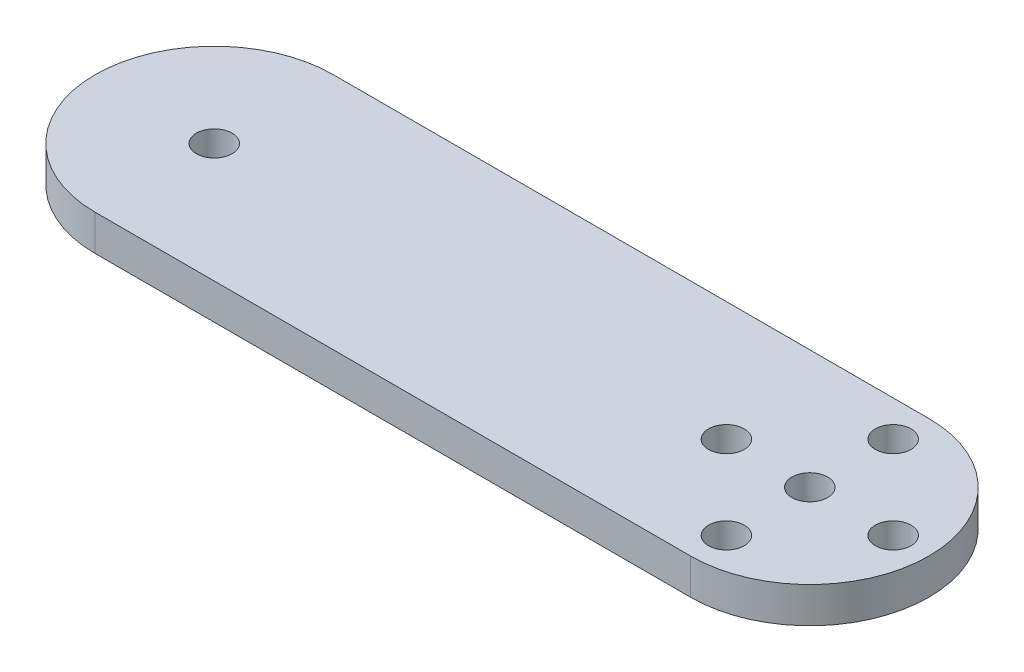
ISO-10303-21;
HEADER;
FILE_DESCRIPTION(('STEP AP214'),'2;1');
FILE_NAME('part.step','',(''),(''),'','','');
FILE_SCHEMA(('AUTOMOTIVE_DESIGN { 1 0 10303 214 1 1 1 1 }'));
ENDSEC;
DATA;
#1=APPLICATION_CONTEXT('core data for automotive mechanical design processes');
#2=APPLICATION_PROTOCOL_DEFINITION('international standard','automotive_design',2000,#1);
#3=PRODUCT_CONTEXT('',#1,'mechanical');
#4=PRODUCT('Part','Part','',(#3));
#5=PRODUCT_RELATED_PRODUCT_CATEGORY('part','',(#4));
#6=PRODUCT_DEFINITION_FORMATION('','',#4);
#7=PRODUCT_DEFINITION_CONTEXT('part definition',#1,'design');
#8=PRODUCT_DEFINITION('design','',#6,#7);
#9=PRODUCT_DEFINITION_SHAPE('','',#8);
#10=(LENGTH_UNIT() NAMED_UNIT(*) SI_UNIT(.MILLI.,.METRE.));
#11=(NAMED_UNIT(*) PLANE_ANGLE_UNIT() SI_UNIT($,.RADIAN.));
#12=(NAMED_UNIT(*) SI_UNIT($,.STERADIAN.) SOLID_ANGLE_UNIT());
#13=UNCERTAINTY_MEASURE_WITH_UNIT(LENGTH_MEASURE(1.E-05),#10,'distance_accuracy_value','');
#14=(GEOMETRIC_REPRESENTATION_CONTEXT(3) GLOBAL_UNCERTAINTY_ASSIGNED_CONTEXT((#13)) GLOBAL_UNIT_ASSIGNED_CONTEXT((#10,
#11,#12)) REPRESENTATION_CONTEXT('',''));
#15=CARTESIAN_POINT('',(0.,0.,0.));
#16=DIRECTION('',(0.,0.,1.));
#17=DIRECTION('',(1.,0.,0.));
#18=AXIS2_PLACEMENT_3D('',#15,#16,#17);
#19=CARTESIAN_POINT('',(0.,3.,-10.));
#20=DIRECTION('',(0.,1.,0.));
#21=DIRECTION('',(0.,0.,1.));
#22=AXIS2_PLACEMENT_3D('',#19,#20,#21);
#23=PLANE('',#22);
#24=CARTESIAN_POINT('',(-7.,3.,-10.));
#25=DIRECTION('',(0.,-1.,0.));
#26=DIRECTION('',(0.,0.,-1.));
#27=AXIS2_PLACEMENT_3D('',#24,#25,#26);
#28=CIRCLE('',#27,1.5);
#29=CARTESIAN_POINT('',(-7.,3.,-11.5));
#30=VERTEX_POINT('',#29);
#31=EDGE_CURVE('E227',#30,#30,#28,.T.);
#32=ORIENTED_EDGE('',*,*,#31,.T.);
#33=EDGE_LOOP('',(#32));
#34=FACE_BOUND('',#33,.T.);
#35=CARTESIAN_POINT('',(7.,3.,-10.));
#36=DIRECTION('',(0.,1.,0.));
#37=DIRECTION('',(0.,0.,1.));
#38=AXIS2_PLACEMENT_3D('',#35,#36,#37);
#39=CIRCLE('',#38,1.5);
#40=CARTESIAN_POINT('',(7.,3.,-8.5));
#41=VERTEX_POINT('',#40);
#42=EDGE_CURVE('E215',#41,#41,#39,.T.);
#43=ORIENTED_EDGE('',*,*,#42,.F.);
#44=EDGE_LOOP('',(#43));
#45=FACE_BOUND('',#44,.T.);
#46=CARTESIAN_POINT('',(-50.,3.,-9.99999999999999));
#47=DIRECTION('',(0.,1.,0.));
#48=DIRECTION('',(0.,0.,1.));
#49=AXIS2_PLACEMENT_3D('',#46,#47,#48);
#50=CIRCLE('',#49,1.5);
#51=CARTESIAN_POINT('',(-50.,3.,-8.49999999999999));
#52=VERTEX_POINT('',#51);
#53=EDGE_CURVE('E190',#52,#52,#50,.T.);
#54=ORIENTED_EDGE('',*,*,#53,.F.);
#55=EDGE_LOOP('',(#54));
#56=FACE_BOUND('',#55,.T.);
#57=CARTESIAN_POINT('',(0.,3.,-10.));
#58=DIRECTION('',(0.,1.,0.));
#59=DIRECTION('',(0.,0.,1.));
#60=AXIS2_PLACEMENT_3D('',#57,#58,#59);
#61=CIRCLE('',#60,10.);
#62=CARTESIAN_POINT('',(0.,3.,0.));
#63=VERTEX_POINT('',#62);
#64=CARTESIAN_POINT('',(0.,3.,-20.));
#65=VERTEX_POINT('',#64);
#66=EDGE_CURVE('E174',#63,#65,#61,.T.);
#67=ORIENTED_EDGE('',*,*,#66,.T.);
#68=DIRECTION('',(-1.,0.,0.));
#69=VECTOR('',#68,1.);
#70=CARTESIAN_POINT('',(0.,3.,-20.));
#71=LINE('',#70,#69);
#72=CARTESIAN_POINT('',(-50.,3.,-20.));
#73=VERTEX_POINT('',#72);
#74=EDGE_CURVE('E166',#65,#73,#71,.T.);
#75=ORIENTED_EDGE('',*,*,#74,.T.);
#76=CARTESIAN_POINT('',(-50.,3.,-9.99999999999999));
#77=DIRECTION('',(0.,-1.,0.));
#78=DIRECTION('',(0.,0.,-1.));
#79=AXIS2_PLACEMENT_3D('',#76,#77,#78);
#80=CIRCLE('',#79,10.);
#81=CARTESIAN_POINT('',(-50.,3.,0.));
#82=VERTEX_POINT('',#81);
#83=EDGE_CURVE('E173',#82,#73,#80,.T.);
#84=ORIENTED_EDGE('',*,*,#83,.F.);
#85=DIRECTION('',(-1.,0.,0.));
#86=VECTOR('',#85,1.);
#87=CARTESIAN_POINT('',(0.,3.,0.));
#88=LINE('',#87,#86);
#89=EDGE_CURVE('E183',#63,#82,#88,.T.);
#90=ORIENTED_EDGE('',*,*,#89,.F.);
#91=EDGE_LOOP('',(#67,#75,#84,#90));
#92=FACE_BOUND('',#91,.T.);
#93=CARTESIAN_POINT('',(0.,3.,-3.));
#94=DIRECTION('',(0.,-1.,0.));
#95=DIRECTION('',(0.,0.,-1.));
#96=AXIS2_PLACEMENT_3D('',#93,#94,#95);
#97=CIRCLE('',#96,1.5);
#98=CARTESIAN_POINT('',(0.,3.,-4.5));
#99=VERTEX_POINT('',#98);
#100=EDGE_CURVE('E203',#99,#99,#97,.T.);
#101=ORIENTED_EDGE('',*,*,#100,.T.);
#102=EDGE_LOOP('',(#101));
#103=FACE_BOUND('',#102,.T.);
#104=CARTESIAN_POINT('',(0.,3.,-10.));
#105=DIRECTION('',(0.,1.,0.));
#106=DIRECTION('',(0.,0.,1.));
#107=AXIS2_PLACEMENT_3D('',#104,#105,#106);
#108=CIRCLE('',#107,1.5);
#109=CARTESIAN_POINT('',(0.,3.,-8.5));
#110=VERTEX_POINT('',#109);
#111=EDGE_CURVE('E209',#110,#110,#108,.T.);
#112=ORIENTED_EDGE('',*,*,#111,.F.);
#113=EDGE_LOOP('',(#112));
#114=FACE_BOUND('',#113,.T.);
#115=CARTESIAN_POINT('',(0.,3.,-17.));
#116=DIRECTION('',(0.,1.,0.));
#117=DIRECTION('',(0.,0.,1.));
#118=AXIS2_PLACEMENT_3D('',#115,#116,#117);
#119=CIRCLE('',#118,1.5);
#120=CARTESIAN_POINT('',(0.,3.,-15.5));
#121=VERTEX_POINT('',#120);
#122=EDGE_CURVE('E221',#121,#121,#119,.T.);
#123=ORIENTED_EDGE('',*,*,#122,.F.);
#124=EDGE_LOOP('',(#123));
#125=FACE_BOUND('',#124,.T.);
#126=ADVANCED_FACE('F124',(#34,#45,#56,#92,#103,#114,#125),#23,.T.);
#127=CARTESIAN_POINT('',(0.,0.,-10.));
#128=DIRECTION('',(0.,1.,0.));
#129=DIRECTION('',(0.,0.,1.));
#130=AXIS2_PLACEMENT_3D('',#127,#128,#129);
#131=PLANE('',#130);
#132=CARTESIAN_POINT('',(-7.,0.,-10.));
#133=DIRECTION('',(0.,-1.,0.));
#134=DIRECTION('',(0.,0.,-1.));
#135=AXIS2_PLACEMENT_3D('',#132,#133,#134);
#136=CIRCLE('',#135,1.5);
#137=CARTESIAN_POINT('',(-7.,0.,-11.5));
#138=VERTEX_POINT('',#137);
#139=EDGE_CURVE('E230',#138,#138,#136,.T.);
#140=ORIENTED_EDGE('',*,*,#139,.F.);
#141=EDGE_LOOP('',(#140));
#142=FACE_BOUND('',#141,.T.);
#143=CARTESIAN_POINT('',(0.,0.,-3.));
#144=DIRECTION('',(0.,-1.,0.));
#145=DIRECTION('',(0.,0.,-1.));
#146=AXIS2_PLACEMENT_3D('',#143,#144,#145);
#147=CIRCLE('',#146,1.5);
#148=CARTESIAN_POINT('',(0.,0.,-4.5));
#149=VERTEX_POINT('',#148);
#150=EDGE_CURVE('E206',#149,#149,#147,.T.);
#151=ORIENTED_EDGE('',*,*,#150,.F.);
#152=EDGE_LOOP('',(#151));
#153=FACE_BOUND('',#152,.T.);
#154=CARTESIAN_POINT('',(0.,0.,-10.));
#155=DIRECTION('',(0.,1.,0.));
#156=DIRECTION('',(0.,0.,1.));
#157=AXIS2_PLACEMENT_3D('',#154,#155,#156);
#158=CIRCLE('',#157,10.);
#159=CARTESIAN_POINT('',(0.,0.,0.));
#160=VERTEX_POINT('',#159);
#161=CARTESIAN_POINT('',(0.,0.,-20.));
#162=VERTEX_POINT('',#161);
#163=EDGE_CURVE('E188',#160,#162,#158,.T.);
#164=ORIENTED_EDGE('',*,*,#163,.F.);
#165=DIRECTION('',(-1.,0.,0.));
#166=VECTOR('',#165,1.);
#167=CARTESIAN_POINT('',(0.,0.,0.));
#168=LINE('',#167,#166);
#169=CARTESIAN_POINT('',(-50.,0.,0.));
#170=VERTEX_POINT('',#169);
#171=EDGE_CURVE('E194',#160,#170,#168,.T.);
#172=ORIENTED_EDGE('',*,*,#171,.T.);
#173=CARTESIAN_POINT('',(-50.,0.,-9.99999999999999));
#174=DIRECTION('',(0.,-1.,0.));
#175=DIRECTION('',(0.,0.,-1.));
#176=AXIS2_PLACEMENT_3D('',#173,#174,#175);
#177=CIRCLE('',#176,10.);
#178=CARTESIAN_POINT('',(-50.,0.,-20.));
#179=VERTEX_POINT('',#178);
#180=EDGE_CURVE('E192',#170,#179,#177,.T.);
#181=ORIENTED_EDGE('',*,*,#180,.T.);
#182=DIRECTION('',(-1.,0.,0.));
#183=VECTOR('',#182,1.);
#184=CARTESIAN_POINT('',(0.,0.,-20.));
#185=LINE('',#184,#183);
#186=EDGE_CURVE('E179',#162,#179,#185,.T.);
#187=ORIENTED_EDGE('',*,*,#186,.F.);
#188=EDGE_LOOP('',(#164,#172,#181,#187));
#189=FACE_BOUND('',#188,.T.);
#190=CARTESIAN_POINT('',(-50.,0.,-9.99999999999999));
#191=DIRECTION('',(0.,1.,0.));
#192=DIRECTION('',(0.,0.,1.));
#193=AXIS2_PLACEMENT_3D('',#190,#191,#192);
#194=CIRCLE('',#193,1.5);
#195=CARTESIAN_POINT('',(-50.,0.,-8.49999999999999));
#196=VERTEX_POINT('',#195);
#197=EDGE_CURVE('E200',#196,#196,#194,.T.);
#198=ORIENTED_EDGE('',*,*,#197,.T.);
#199=EDGE_LOOP('',(#198));
#200=FACE_BOUND('',#199,.T.);
#201=CARTESIAN_POINT('',(0.,0.,-10.));
#202=DIRECTION('',(0.,1.,0.));
#203=DIRECTION('',(0.,0.,1.));
#204=AXIS2_PLACEMENT_3D('',#201,#202,#203);
#205=CIRCLE('',#204,1.5);
#206=CARTESIAN_POINT('',(0.,0.,-8.5));
#207=VERTEX_POINT('',#206);
#208=EDGE_CURVE('E212',#207,#207,#205,.T.);
#209=ORIENTED_EDGE('',*,*,#208,.T.);
#210=EDGE_LOOP('',(#209));
#211=FACE_BOUND('',#210,.T.);
#212=CARTESIAN_POINT('',(7.,0.,-10.));
#213=DIRECTION('',(0.,1.,0.));
#214=DIRECTION('',(0.,0.,1.));
#215=AXIS2_PLACEMENT_3D('',#212,#213,#214);
#216=CIRCLE('',#215,1.5);
#217=CARTESIAN_POINT('',(7.,0.,-8.5));
#218=VERTEX_POINT('',#217);
#219=EDGE_CURVE('E218',#218,#218,#216,.T.);
#220=ORIENTED_EDGE('',*,*,#219,.T.);
#221=EDGE_LOOP('',(#220));
#222=FACE_BOUND('',#221,.T.);
#223=CARTESIAN_POINT('',(0.,0.,-17.));
#224=DIRECTION('',(0.,1.,0.));
#225=DIRECTION('',(0.,0.,1.));
#226=AXIS2_PLACEMENT_3D('',#223,#224,#225);
#227=CIRCLE('',#226,1.5);
#228=CARTESIAN_POINT('',(0.,0.,-15.5));
#229=VERTEX_POINT('',#228);
#230=EDGE_CURVE('E224',#229,#229,#227,.T.);
#231=ORIENTED_EDGE('',*,*,#230,.T.);
#232=EDGE_LOOP('',(#231));
#233=FACE_BOUND('',#232,.T.);
#234=ADVANCED_FACE('F245',(#142,#153,#189,#200,#211,#222,#233),#131,.F.);
#235=CARTESIAN_POINT('',(0.,3.,-10.));
#236=DIRECTION('',(0.,-1.,0.));
#237=DIRECTION('',(0.,0.,-1.));
#238=AXIS2_PLACEMENT_3D('',#235,#236,#237);
#239=CYLINDRICAL_SURFACE('',#238,10.);
#240=ORIENTED_EDGE('',*,*,#163,.T.);
#241=DIRECTION('',(0.,-1.,0.));
#242=VECTOR('',#241,1.);
#243=CARTESIAN_POINT('',(0.,3.,-20.));
#244=LINE('',#243,#242);
#245=EDGE_CURVE('E12',#65,#162,#244,.T.);
#246=ORIENTED_EDGE('',*,*,#245,.F.);
#247=ORIENTED_EDGE('',*,*,#66,.F.);
#248=DIRECTION('',(0.,-1.,0.));
#249=VECTOR('',#248,1.);
#250=CARTESIAN_POINT('',(0.,3.,0.));
#251=LINE('',#250,#249);
#252=EDGE_CURVE('E141',#63,#160,#251,.T.);
#253=ORIENTED_EDGE('',*,*,#252,.T.);
#254=EDGE_LOOP('',(#240,#246,#247,#253));
#255=FACE_BOUND('',#254,.T.);
#256=ADVANCED_FACE('F126',(#255),#239,.T.);
#257=CARTESIAN_POINT('',(0.,3.,-20.));
#258=DIRECTION('',(0.,0.,1.));
#259=DIRECTION('',(1.,0.,0.));
#260=AXIS2_PLACEMENT_3D('',#257,#258,#259);
#261=PLANE('',#260);
#262=ORIENTED_EDGE('',*,*,#186,.T.);
#263=DIRECTION('',(0.,-1.,0.));
#264=VECTOR('',#263,1.);
#265=CARTESIAN_POINT('',(-50.,3.,-20.));
#266=LINE('',#265,#264);
#267=EDGE_CURVE('E133',#73,#179,#266,.T.);
#268=ORIENTED_EDGE('',*,*,#267,.F.);
#269=ORIENTED_EDGE('',*,*,#74,.F.);
#270=ORIENTED_EDGE('',*,*,#245,.T.);
#271=EDGE_LOOP('',(#262,#268,#269,#270));
#272=FACE_BOUND('',#271,.T.);
#273=ADVANCED_FACE('F178',(#272),#261,.F.);
#274=CARTESIAN_POINT('',(-50.,3.,-9.99999999999999));
#275=DIRECTION('',(0.,-1.,0.));
#276=DIRECTION('',(0.,0.,-1.));
#277=AXIS2_PLACEMENT_3D('',#274,#275,#276);
#278=CYLINDRICAL_SURFACE('',#277,10.);
#279=ORIENTED_EDGE('',*,*,#180,.F.);
#280=DIRECTION('',(0.,-1.,0.));
#281=VECTOR('',#280,1.);
#282=CARTESIAN_POINT('',(-50.,3.,0.));
#283=LINE('',#282,#281);
#284=EDGE_CURVE('E155',#82,#170,#283,.T.);
#285=ORIENTED_EDGE('',*,*,#284,.F.);
#286=ORIENTED_EDGE('',*,*,#83,.T.);
#287=ORIENTED_EDGE('',*,*,#267,.T.);
#288=EDGE_LOOP('',(#279,#285,#286,#287));
#289=FACE_BOUND('',#288,.T.);
#290=ADVANCED_FACE('F182',(#289),#278,.T.);
#291=CARTESIAN_POINT('',(0.,3.,0.));
#292=DIRECTION('',(0.,0.,1.));
#293=DIRECTION('',(1.,0.,0.));
#294=AXIS2_PLACEMENT_3D('',#291,#292,#293);
#295=PLANE('',#294);
#296=ORIENTED_EDGE('',*,*,#171,.F.);
#297=ORIENTED_EDGE('',*,*,#252,.F.);
#298=ORIENTED_EDGE('',*,*,#89,.T.);
#299=ORIENTED_EDGE('',*,*,#284,.T.);
#300=EDGE_LOOP('',(#296,#297,#298,#299));
#301=FACE_BOUND('',#300,.T.);
#302=ADVANCED_FACE('F277',(#301),#295,.T.);
#303=CARTESIAN_POINT('',(-50.,3.,-9.99999999999999));
#304=DIRECTION('',(0.,-1.,0.));
#305=DIRECTION('',(0.,0.,-1.));
#306=AXIS2_PLACEMENT_3D('',#303,#304,#305);
#307=CYLINDRICAL_SURFACE('',#306,1.5);
#308=ORIENTED_EDGE('',*,*,#53,.T.);
#309=EDGE_LOOP('',(#308));
#310=FACE_BOUND('',#309,.T.);
#311=ORIENTED_EDGE('',*,*,#197,.F.);
#312=EDGE_LOOP('',(#311));
#313=FACE_BOUND('',#312,.T.);
#314=ADVANCED_FACE('F274',(#310,#313),#307,.F.);
#315=CARTESIAN_POINT('',(0.,3.,-3.));
#316=DIRECTION('',(0.,-1.,0.));
#317=DIRECTION('',(0.,0.,-1.));
#318=AXIS2_PLACEMENT_3D('',#315,#316,#317);
#319=CYLINDRICAL_SURFACE('',#318,1.5);
#320=ORIENTED_EDGE('',*,*,#100,.F.);
#321=EDGE_LOOP('',(#320));
#322=FACE_BOUND('',#321,.T.);
#323=ORIENTED_EDGE('',*,*,#150,.T.);
#324=EDGE_LOOP('',(#323));
#325=FACE_BOUND('',#324,.T.);
#326=ADVANCED_FACE('F321',(#322,#325),#319,.F.);
#327=CARTESIAN_POINT('',(0.,3.,-10.));
#328=DIRECTION('',(0.,-1.,0.));
#329=DIRECTION('',(0.,0.,-1.));
#330=AXIS2_PLACEMENT_3D('',#327,#328,#329);
#331=CYLINDRICAL_SURFACE('',#330,1.5);
#332=ORIENTED_EDGE('',*,*,#111,.T.);
#333=EDGE_LOOP('',(#332));
#334=FACE_BOUND('',#333,.T.);
#335=ORIENTED_EDGE('',*,*,#208,.F.);
#336=EDGE_LOOP('',(#335));
#337=FACE_BOUND('',#336,.T.);
#338=ADVANCED_FACE('F266',(#334,#337),#331,.F.);
#339=CARTESIAN_POINT('',(7.,3.,-10.));
#340=DIRECTION('',(0.,-1.,0.));
#341=DIRECTION('',(0.,0.,-1.));
#342=AXIS2_PLACEMENT_3D('',#339,#340,#341);
#343=CYLINDRICAL_SURFACE('',#342,1.5);
#344=ORIENTED_EDGE('',*,*,#42,.T.);
#345=EDGE_LOOP('',(#344));
#346=FACE_BOUND('',#345,.T.);
#347=ORIENTED_EDGE('',*,*,#219,.F.);
#348=EDGE_LOOP('',(#347));
#349=FACE_BOUND('',#348,.T.);
#350=ADVANCED_FACE('F260',(#346,#349),#343,.F.);
#351=CARTESIAN_POINT('',(0.,3.,-17.));
#352=DIRECTION('',(0.,-1.,0.));
#353=DIRECTION('',(0.,0.,-1.));
#354=AXIS2_PLACEMENT_3D('',#351,#352,#353);
#355=CYLINDRICAL_SURFACE('',#354,1.5);
#356=ORIENTED_EDGE('',*,*,#122,.T.);
#357=EDGE_LOOP('',(#356));
#358=FACE_BOUND('',#357,.T.);
#359=ORIENTED_EDGE('',*,*,#230,.F.);
#360=EDGE_LOOP('',(#359));
#361=FACE_BOUND('',#360,.T.);
#362=ADVANCED_FACE('F241',(#358,#361),#355,.F.);
#363=CARTESIAN_POINT('',(-7.,3.,-10.));
#364=DIRECTION('',(0.,-1.,0.));
#365=DIRECTION('',(0.,0.,-1.));
#366=AXIS2_PLACEMENT_3D('',#363,#364,#365);
#367=CYLINDRICAL_SURFACE('',#366,1.5);
#368=ORIENTED_EDGE('',*,*,#31,.F.);
#369=EDGE_LOOP('',(#368));
#370=FACE_BOUND('',#369,.T.);
#371=ORIENTED_EDGE('',*,*,#139,.T.);
#372=EDGE_LOOP('',(#371));
#373=FACE_BOUND('',#372,.T.);
#374=ADVANCED_FACE('F238',(#370,#373),#367,.F.);
#375=CLOSED_SHELL('',(#126,#234,#256,#273,#290,#302,#314,#326,#338,#350,#362,#374));
#376=MANIFOLD_SOLID_BREP('B2',#375);
#377=ADVANCED_BREP_SHAPE_REPRESENTATION('',(#18,#376),#14);
#378=SHAPE_DEFINITION_REPRESENTATION(#9,#377);
ENDSEC;
END-ISO-10303-21;
